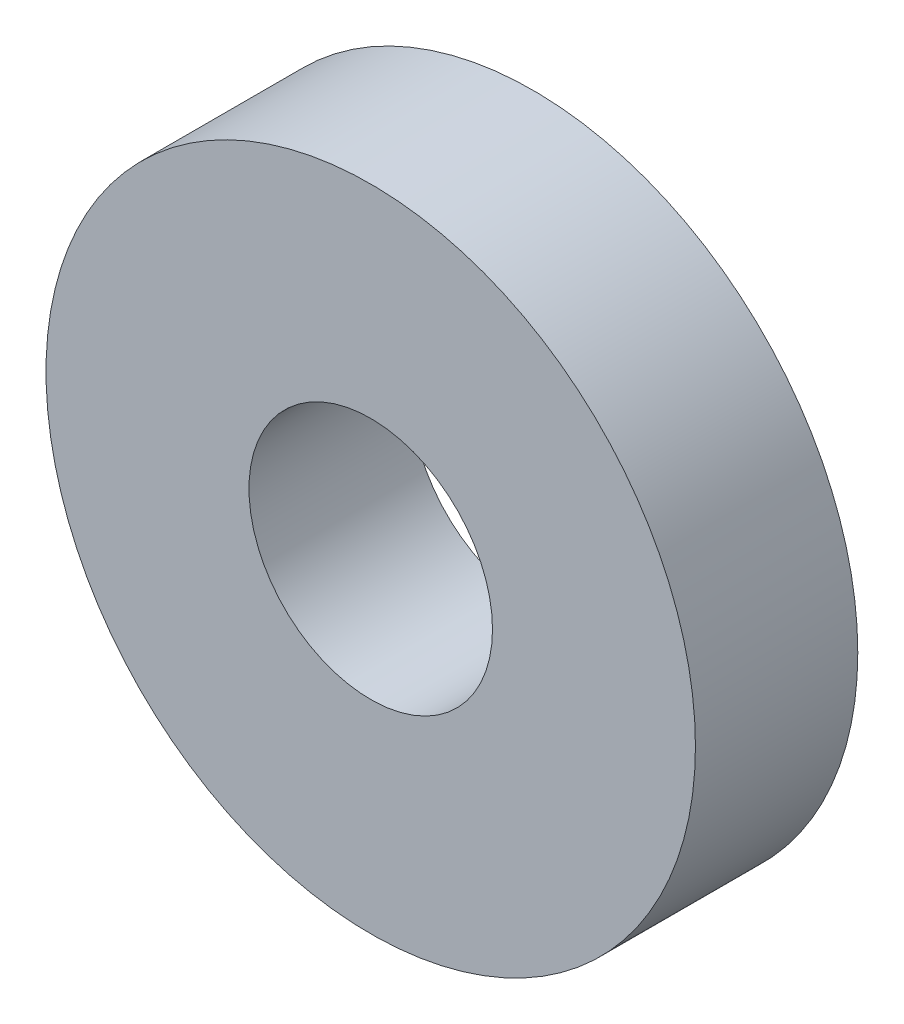
ISO-10303-21;
HEADER;
FILE_DESCRIPTION(('STEP AP214'),'2;1');
FILE_NAME('part.step','',(''),(''),'','','');
FILE_SCHEMA(('AUTOMOTIVE_DESIGN { 1 0 10303 214 1 1 1 1 }'));
ENDSEC;
DATA;
#1=APPLICATION_CONTEXT('core data for automotive mechanical design processes');
#2=APPLICATION_PROTOCOL_DEFINITION('international standard','automotive_design',2000,#1);
#3=PRODUCT_CONTEXT('',#1,'mechanical');
#4=PRODUCT('Part','Part','',(#3));
#5=PRODUCT_RELATED_PRODUCT_CATEGORY('part','',(#4));
#6=PRODUCT_DEFINITION_FORMATION('','',#4);
#7=PRODUCT_DEFINITION_CONTEXT('part definition',#1,'design');
#8=PRODUCT_DEFINITION('design','',#6,#7);
#9=PRODUCT_DEFINITION_SHAPE('','',#8);
#10=(LENGTH_UNIT() NAMED_UNIT(*) SI_UNIT(.MILLI.,.METRE.));
#11=(NAMED_UNIT(*) PLANE_ANGLE_UNIT() SI_UNIT($,.RADIAN.));
#12=(NAMED_UNIT(*) SI_UNIT($,.STERADIAN.) SOLID_ANGLE_UNIT());
#13=UNCERTAINTY_MEASURE_WITH_UNIT(LENGTH_MEASURE(1.E-05),#10,'distance_accuracy_value','');
#14=(GEOMETRIC_REPRESENTATION_CONTEXT(3) GLOBAL_UNCERTAINTY_ASSIGNED_CONTEXT((#13)) GLOBAL_UNIT_ASSIGNED_CONTEXT((#10,
#11,#12)) REPRESENTATION_CONTEXT('',''));
#15=CARTESIAN_POINT('',(0.,0.,0.));
#16=DIRECTION('',(0.,0.,1.));
#17=DIRECTION('',(1.,0.,0.));
#18=AXIS2_PLACEMENT_3D('',#15,#16,#17);
#19=CARTESIAN_POINT('',(0.,0.,4.));
#20=DIRECTION('',(0.,0.,1.));
#21=DIRECTION('',(1.,0.,0.));
#22=AXIS2_PLACEMENT_3D('',#19,#20,#21);
#23=PLANE('',#22);
#24=CARTESIAN_POINT('',(0.,0.,4.));
#25=DIRECTION('',(0.,0.,1.));
#26=DIRECTION('',(1.,0.,0.));
#27=AXIS2_PLACEMENT_3D('',#24,#25,#26);
#28=CIRCLE('',#27,8.);
#29=CARTESIAN_POINT('',(8.,0.,4.));
#30=VERTEX_POINT('',#29);
#31=EDGE_CURVE('E10',#30,#30,#28,.T.);
#32=ORIENTED_EDGE('',*,*,#31,.T.);
#33=EDGE_LOOP('',(#32));
#34=FACE_BOUND('',#33,.T.);
#35=CARTESIAN_POINT('',(0.,0.,4.));
#36=DIRECTION('',(0.,0.,1.));
#37=DIRECTION('',(1.,0.,0.));
#38=AXIS2_PLACEMENT_3D('',#35,#36,#37);
#39=CIRCLE('',#38,3.);
#40=CARTESIAN_POINT('',(3.,0.,4.));
#41=VERTEX_POINT('',#40);
#42=EDGE_CURVE('E42',#41,#41,#39,.T.);
#43=ORIENTED_EDGE('',*,*,#42,.F.);
#44=EDGE_LOOP('',(#43));
#45=FACE_BOUND('',#44,.T.);
#46=ADVANCED_FACE('F31',(#34,#45),#23,.T.);
#47=CARTESIAN_POINT('',(0.,0.,0.));
#48=DIRECTION('',(0.,0.,1.));
#49=DIRECTION('',(1.,0.,0.));
#50=AXIS2_PLACEMENT_3D('',#47,#48,#49);
#51=PLANE('',#50);
#52=CARTESIAN_POINT('',(0.,0.,0.));
#53=DIRECTION('',(0.,0.,1.));
#54=DIRECTION('',(1.,0.,0.));
#55=AXIS2_PLACEMENT_3D('',#52,#53,#54);
#56=CIRCLE('',#55,8.);
#57=CARTESIAN_POINT('',(8.,0.,0.));
#58=VERTEX_POINT('',#57);
#59=EDGE_CURVE('E35',#58,#58,#56,.T.);
#60=ORIENTED_EDGE('',*,*,#59,.F.);
#61=EDGE_LOOP('',(#60));
#62=FACE_BOUND('',#61,.T.);
#63=CARTESIAN_POINT('',(0.,0.,0.));
#64=DIRECTION('',(0.,0.,1.));
#65=DIRECTION('',(1.,0.,0.));
#66=AXIS2_PLACEMENT_3D('',#63,#64,#65);
#67=CIRCLE('',#66,3.);
#68=CARTESIAN_POINT('',(3.,0.,0.));
#69=VERTEX_POINT('',#68);
#70=EDGE_CURVE('E44',#69,#69,#67,.T.);
#71=ORIENTED_EDGE('',*,*,#70,.T.);
#72=EDGE_LOOP('',(#71));
#73=FACE_BOUND('',#72,.T.);
#74=ADVANCED_FACE('F54',(#62,#73),#51,.F.);
#75=CARTESIAN_POINT('',(0.,0.,4.));
#76=DIRECTION('',(0.,0.,-1.));
#77=DIRECTION('',(-1.,0.,0.));
#78=AXIS2_PLACEMENT_3D('',#75,#76,#77);
#79=CYLINDRICAL_SURFACE('',#78,8.);
#80=ORIENTED_EDGE('',*,*,#31,.F.);
#81=EDGE_LOOP('',(#80));
#82=FACE_BOUND('',#81,.T.);
#83=ORIENTED_EDGE('',*,*,#59,.T.);
#84=EDGE_LOOP('',(#83));
#85=FACE_BOUND('',#84,.T.);
#86=ADVANCED_FACE('F33',(#82,#85),#79,.T.);
#87=CARTESIAN_POINT('',(0.,0.,4.));
#88=DIRECTION('',(0.,0.,-1.));
#89=DIRECTION('',(-1.,0.,0.));
#90=AXIS2_PLACEMENT_3D('',#87,#88,#89);
#91=CYLINDRICAL_SURFACE('',#90,3.);
#92=ORIENTED_EDGE('',*,*,#42,.T.);
#93=EDGE_LOOP('',(#92));
#94=FACE_BOUND('',#93,.T.);
#95=ORIENTED_EDGE('',*,*,#70,.F.);
#96=EDGE_LOOP('',(#95));
#97=FACE_BOUND('',#96,.T.);
#98=ADVANCED_FACE('F50',(#94,#97),#91,.F.);
#99=CLOSED_SHELL('',(#46,#74,#86,#98));
#100=MANIFOLD_SOLID_BREP('B2',#99);
#101=ADVANCED_BREP_SHAPE_REPRESENTATION('',(#18,#100),#14);
#102=SHAPE_DEFINITION_REPRESENTATION(#9,#101);
ENDSEC;
END-ISO-10303-21;
